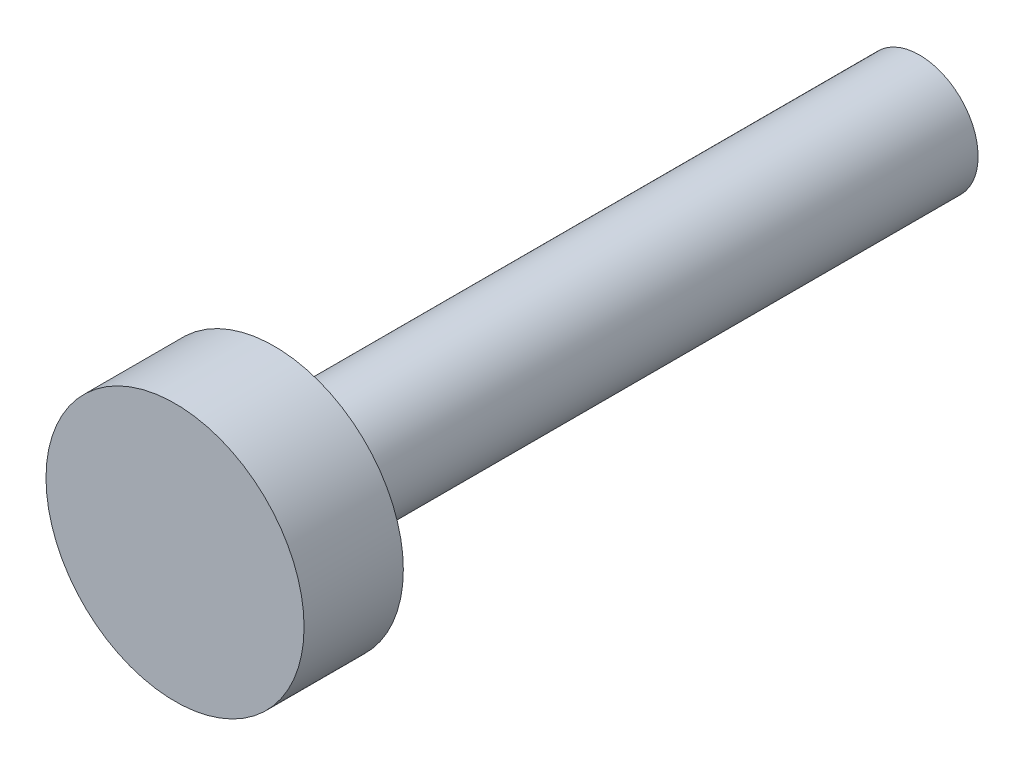
ISO-10303-21;
HEADER;
FILE_DESCRIPTION(('STEP AP214'),'2;1');
FILE_NAME('part.step','',(''),(''),'','','');
FILE_SCHEMA(('AUTOMOTIVE_DESIGN { 1 0 10303 214 1 1 1 1 }'));
ENDSEC;
DATA;
#1=APPLICATION_CONTEXT('core data for automotive mechanical design processes');
#2=APPLICATION_PROTOCOL_DEFINITION('international standard','automotive_design',2000,#1);
#3=PRODUCT_CONTEXT('',#1,'mechanical');
#4=PRODUCT('Part','Part','',(#3));
#5=PRODUCT_RELATED_PRODUCT_CATEGORY('part','',(#4));
#6=PRODUCT_DEFINITION_FORMATION('','',#4);
#7=PRODUCT_DEFINITION_CONTEXT('part definition',#1,'design');
#8=PRODUCT_DEFINITION('design','',#6,#7);
#9=PRODUCT_DEFINITION_SHAPE('','',#8);
#10=(LENGTH_UNIT() NAMED_UNIT(*) SI_UNIT(.MILLI.,.METRE.));
#11=(NAMED_UNIT(*) PLANE_ANGLE_UNIT() SI_UNIT($,.RADIAN.));
#12=(NAMED_UNIT(*) SI_UNIT($,.STERADIAN.) SOLID_ANGLE_UNIT());
#13=UNCERTAINTY_MEASURE_WITH_UNIT(LENGTH_MEASURE(1.E-05),#10,'distance_accuracy_value','');
#14=(GEOMETRIC_REPRESENTATION_CONTEXT(3) GLOBAL_UNCERTAINTY_ASSIGNED_CONTEXT((#13)) GLOBAL_UNIT_ASSIGNED_CONTEXT((#10,
#11,#12)) REPRESENTATION_CONTEXT('',''));
#15=CARTESIAN_POINT('',(0.,0.,0.));
#16=DIRECTION('',(0.,0.,1.));
#17=DIRECTION('',(1.,0.,0.));
#18=AXIS2_PLACEMENT_3D('',#15,#16,#17);
#19=CARTESIAN_POINT('',(0.,0.,19.05));
#20=DIRECTION('',(0.,0.,-1.));
#21=DIRECTION('',(-1.,0.,0.));
#22=AXIS2_PLACEMENT_3D('',#19,#20,#21);
#23=CYLINDRICAL_SURFACE('',#22,3.302);
#24=CARTESIAN_POINT('',(0.,0.,19.05));
#25=DIRECTION('',(0.,0.,1.));
#26=DIRECTION('',(1.,0.,0.));
#27=AXIS2_PLACEMENT_3D('',#24,#25,#26);
#28=CIRCLE('',#27,3.302);
#29=CARTESIAN_POINT('',(3.302,0.,19.05));
#30=VERTEX_POINT('',#29);
#31=EDGE_CURVE('E11',#30,#30,#28,.T.);
#32=ORIENTED_EDGE('',*,*,#31,.F.);
#33=EDGE_LOOP('',(#32));
#34=FACE_BOUND('',#33,.T.);
#35=CARTESIAN_POINT('',(0.,0.,16.51));
#36=DIRECTION('',(0.,0.,-1.));
#37=DIRECTION('',(-1.,0.,0.));
#38=AXIS2_PLACEMENT_3D('',#35,#36,#37);
#39=CIRCLE('',#38,3.302);
#40=CARTESIAN_POINT('',(-3.302,0.,16.51));
#41=VERTEX_POINT('',#40);
#42=EDGE_CURVE('E33',#41,#41,#39,.T.);
#43=ORIENTED_EDGE('',*,*,#42,.F.);
#44=EDGE_LOOP('',(#43));
#45=FACE_BOUND('',#44,.T.);
#46=ADVANCED_FACE('F30',(#34,#45),#23,.T.);
#47=CARTESIAN_POINT('',(0.,0.,19.05));
#48=DIRECTION('',(0.,0.,1.));
#49=DIRECTION('',(1.,0.,0.));
#50=AXIS2_PLACEMENT_3D('',#47,#48,#49);
#51=PLANE('',#50);
#52=ORIENTED_EDGE('',*,*,#31,.T.);
#53=EDGE_LOOP('',(#52));
#54=FACE_BOUND('',#53,.T.);
#55=ADVANCED_FACE('F54',(#54),#51,.T.);
#56=CARTESIAN_POINT('',(0.,0.,16.51));
#57=DIRECTION('',(0.,0.,-1.));
#58=DIRECTION('',(-1.,0.,0.));
#59=AXIS2_PLACEMENT_3D('',#56,#57,#58);
#60=PLANE('',#59);
#61=CARTESIAN_POINT('',(0.,0.,16.51));
#62=DIRECTION('',(0.,0.,-1.));
#63=DIRECTION('',(-1.,0.,0.));
#64=AXIS2_PLACEMENT_3D('',#61,#62,#63);
#65=CIRCLE('',#64,1.5);
#66=CARTESIAN_POINT('',(-1.5,0.,16.51));
#67=VERTEX_POINT('',#66);
#68=EDGE_CURVE('E40',#67,#67,#65,.T.);
#69=ORIENTED_EDGE('',*,*,#68,.F.);
#70=EDGE_LOOP('',(#69));
#71=FACE_BOUND('',#70,.T.);
#72=ORIENTED_EDGE('',*,*,#42,.T.);
#73=EDGE_LOOP('',(#72));
#74=FACE_BOUND('',#73,.T.);
#75=ADVANCED_FACE('F51',(#71,#74),#60,.T.);
#76=CARTESIAN_POINT('',(0.,0.,16.51));
#77=DIRECTION('',(0.,0.,-1.));
#78=DIRECTION('',(-1.,0.,0.));
#79=AXIS2_PLACEMENT_3D('',#76,#77,#78);
#80=CYLINDRICAL_SURFACE('',#79,1.5);
#81=ORIENTED_EDGE('',*,*,#68,.T.);
#82=EDGE_LOOP('',(#81));
#83=FACE_BOUND('',#82,.T.);
#84=CARTESIAN_POINT('',(0.,0.,0.));
#85=DIRECTION('',(0.,0.,-1.));
#86=DIRECTION('',(-1.,0.,0.));
#87=AXIS2_PLACEMENT_3D('',#84,#85,#86);
#88=CIRCLE('',#87,1.5);
#89=CARTESIAN_POINT('',(-1.5,0.,0.));
#90=VERTEX_POINT('',#89);
#91=EDGE_CURVE('E42',#90,#90,#88,.T.);
#92=ORIENTED_EDGE('',*,*,#91,.F.);
#93=EDGE_LOOP('',(#92));
#94=FACE_BOUND('',#93,.T.);
#95=ADVANCED_FACE('F48',(#83,#94),#80,.T.);
#96=CARTESIAN_POINT('',(0.,0.,0.));
#97=DIRECTION('',(0.,0.,1.));
#98=DIRECTION('',(1.,0.,0.));
#99=AXIS2_PLACEMENT_3D('',#96,#97,#98);
#100=PLANE('',#99);
#101=ORIENTED_EDGE('',*,*,#91,.T.);
#102=EDGE_LOOP('',(#101));
#103=FACE_BOUND('',#102,.T.);
#104=ADVANCED_FACE('F67',(#103),#100,.F.);
#105=CLOSED_SHELL('',(#46,#55,#75,#95,#104));
#106=MANIFOLD_SOLID_BREP('B2',#105);
#107=ADVANCED_BREP_SHAPE_REPRESENTATION('',(#18,#106),#14);
#108=SHAPE_DEFINITION_REPRESENTATION(#9,#107);
ENDSEC;
END-ISO-10303-21;
